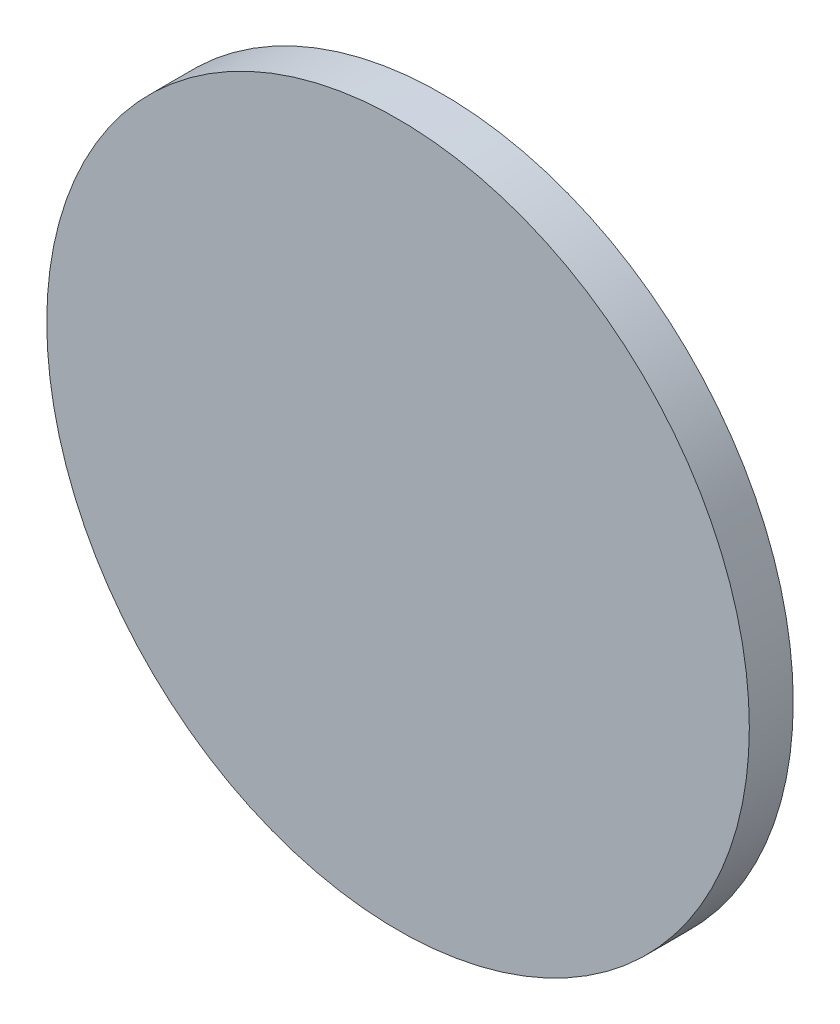
ISO-10303-21;
HEADER;
FILE_DESCRIPTION(('STEP AP214'),'2;1');
FILE_NAME('part.step','',(''),(''),'','','');
FILE_SCHEMA(('AUTOMOTIVE_DESIGN { 1 0 10303 214 1 1 1 1 }'));
ENDSEC;
DATA;
#1=APPLICATION_CONTEXT('core data for automotive mechanical design processes');
#2=APPLICATION_PROTOCOL_DEFINITION('international standard','automotive_design',2000,#1);
#3=PRODUCT_CONTEXT('',#1,'mechanical');
#4=PRODUCT('Part','Part','',(#3));
#5=PRODUCT_RELATED_PRODUCT_CATEGORY('part','',(#4));
#6=PRODUCT_DEFINITION_FORMATION('','',#4);
#7=PRODUCT_DEFINITION_CONTEXT('part definition',#1,'design');
#8=PRODUCT_DEFINITION('design','',#6,#7);
#9=PRODUCT_DEFINITION_SHAPE('','',#8);
#10=(LENGTH_UNIT() NAMED_UNIT(*) SI_UNIT(.MILLI.,.METRE.));
#11=(NAMED_UNIT(*) PLANE_ANGLE_UNIT() SI_UNIT($,.RADIAN.));
#12=(NAMED_UNIT(*) SI_UNIT($,.STERADIAN.) SOLID_ANGLE_UNIT());
#13=UNCERTAINTY_MEASURE_WITH_UNIT(LENGTH_MEASURE(1.E-05),#10,'distance_accuracy_value','');
#14=(GEOMETRIC_REPRESENTATION_CONTEXT(3) GLOBAL_UNCERTAINTY_ASSIGNED_CONTEXT((#13)) GLOBAL_UNIT_ASSIGNED_CONTEXT((#10,
#11,#12)) REPRESENTATION_CONTEXT('',''));
#15=CARTESIAN_POINT('',(0.,0.,0.));
#16=DIRECTION('',(0.,0.,1.));
#17=DIRECTION('',(1.,0.,0.));
#18=AXIS2_PLACEMENT_3D('',#15,#16,#17);
#19=CARTESIAN_POINT('',(0.,0.,3.175));
#20=DIRECTION('',(0.,0.,-1.));
#21=DIRECTION('',(-1.,0.,0.));
#22=AXIS2_PLACEMENT_3D('',#19,#20,#21);
#23=CYLINDRICAL_SURFACE('',#22,25.4);
#24=CARTESIAN_POINT('',(0.,0.,3.175));
#25=DIRECTION('',(0.,0.,1.));
#26=DIRECTION('',(1.,0.,0.));
#27=AXIS2_PLACEMENT_3D('',#24,#25,#26);
#28=CIRCLE('',#27,25.4);
#29=CARTESIAN_POINT('',(25.4,0.,3.175));
#30=VERTEX_POINT('',#29);
#31=EDGE_CURVE('E10',#30,#30,#28,.T.);
#32=ORIENTED_EDGE('',*,*,#31,.F.);
#33=EDGE_LOOP('',(#32));
#34=FACE_BOUND('',#33,.T.);
#35=CARTESIAN_POINT('',(0.,0.,0.));
#36=DIRECTION('',(0.,0.,1.));
#37=DIRECTION('',(1.,0.,0.));
#38=AXIS2_PLACEMENT_3D('',#35,#36,#37);
#39=CIRCLE('',#38,25.4);
#40=CARTESIAN_POINT('',(25.4,0.,0.));
#41=VERTEX_POINT('',#40);
#42=EDGE_CURVE('E38',#41,#41,#39,.T.);
#43=ORIENTED_EDGE('',*,*,#42,.T.);
#44=EDGE_LOOP('',(#43));
#45=FACE_BOUND('',#44,.T.);
#46=ADVANCED_FACE('F35',(#34,#45),#23,.T.);
#47=CARTESIAN_POINT('',(0.,0.,3.175));
#48=DIRECTION('',(0.,0.,1.));
#49=DIRECTION('',(1.,0.,0.));
#50=AXIS2_PLACEMENT_3D('',#47,#48,#49);
#51=PLANE('',#50);
#52=ORIENTED_EDGE('',*,*,#31,.T.);
#53=EDGE_LOOP('',(#52));
#54=FACE_BOUND('',#53,.T.);
#55=ADVANCED_FACE('F52',(#54),#51,.T.);
#56=CARTESIAN_POINT('',(0.,0.,0.));
#57=DIRECTION('',(0.,0.,1.));
#58=DIRECTION('',(1.,0.,0.));
#59=AXIS2_PLACEMENT_3D('',#56,#57,#58);
#60=PLANE('',#59);
#61=ORIENTED_EDGE('',*,*,#42,.F.);
#62=EDGE_LOOP('',(#61));
#63=FACE_BOUND('',#62,.T.);
#64=ADVANCED_FACE('F50',(#63),#60,.F.);
#65=CLOSED_SHELL('',(#46,#55,#64));
#66=MANIFOLD_SOLID_BREP('B2',#65);
#67=ADVANCED_BREP_SHAPE_REPRESENTATION('',(#18,#66),#14);
#68=SHAPE_DEFINITION_REPRESENTATION(#9,#67);
ENDSEC;
END-ISO-10303-21;
